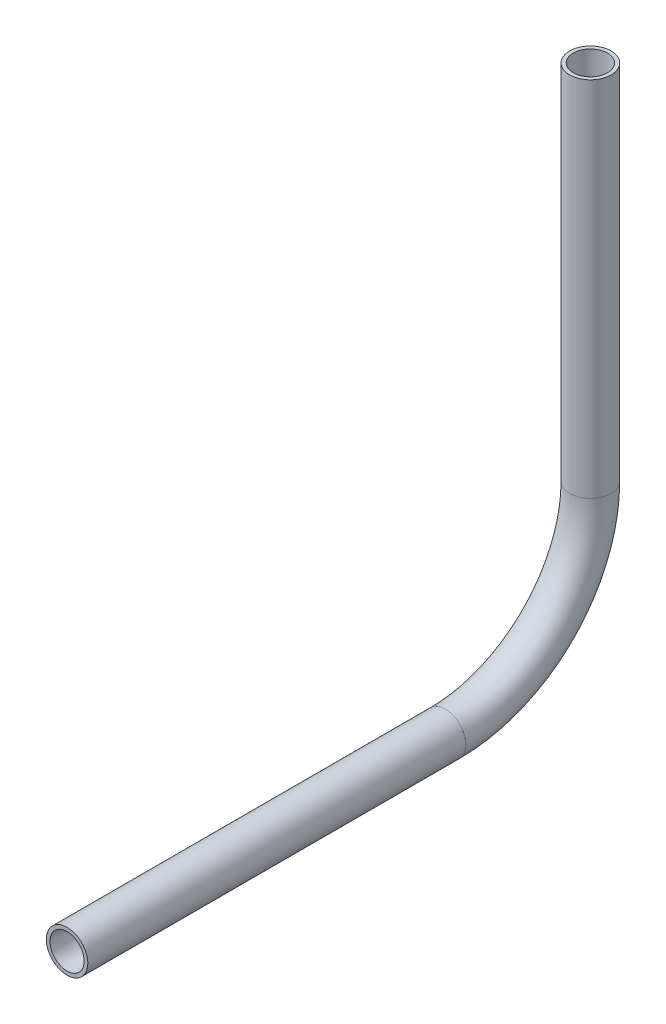
ISO-10303-21;
HEADER;
FILE_DESCRIPTION(('STEP AP214'),'2;1');
FILE_NAME('part.step','',(''),(''),'','','');
FILE_SCHEMA(('AUTOMOTIVE_DESIGN { 1 0 10303 214 1 1 1 1 }'));
ENDSEC;
DATA;
#1=APPLICATION_CONTEXT('core data for automotive mechanical design processes');
#2=APPLICATION_PROTOCOL_DEFINITION('international standard','automotive_design',2000,#1);
#3=PRODUCT_CONTEXT('',#1,'mechanical');
#4=PRODUCT('Part','Part','',(#3));
#5=PRODUCT_RELATED_PRODUCT_CATEGORY('part','',(#4));
#6=PRODUCT_DEFINITION_FORMATION('','',#4);
#7=PRODUCT_DEFINITION_CONTEXT('part definition',#1,'design');
#8=PRODUCT_DEFINITION('design','',#6,#7);
#9=PRODUCT_DEFINITION_SHAPE('','',#8);
#10=(LENGTH_UNIT() NAMED_UNIT(*) SI_UNIT(.MILLI.,.METRE.));
#11=(NAMED_UNIT(*) PLANE_ANGLE_UNIT() SI_UNIT($,.RADIAN.));
#12=(NAMED_UNIT(*) SI_UNIT($,.STERADIAN.) SOLID_ANGLE_UNIT());
#13=UNCERTAINTY_MEASURE_WITH_UNIT(LENGTH_MEASURE(1.E-05),#10,'distance_accuracy_value','');
#14=(GEOMETRIC_REPRESENTATION_CONTEXT(3) GLOBAL_UNCERTAINTY_ASSIGNED_CONTEXT((#13)) GLOBAL_UNIT_ASSIGNED_CONTEXT((#10,
#11,#12)) REPRESENTATION_CONTEXT('',''));
#15=CARTESIAN_POINT('',(0.,0.,0.));
#16=DIRECTION('',(0.,0.,1.));
#17=DIRECTION('',(1.,0.,0.));
#18=AXIS2_PLACEMENT_3D('',#15,#16,#17);
#19=CARTESIAN_POINT('',(0.,251.505538406434,74.7674547745198));
#20=DIRECTION('',(0.,0.,1.));
#21=DIRECTION('',(1.,0.,0.));
#22=AXIS2_PLACEMENT_3D('',#19,#20,#21);
#23=CYLINDRICAL_SURFACE('',#22,2.61620000000002);
#24=CARTESIAN_POINT('',(0.,251.505538406434,132.634510623571));
#25=DIRECTION('',(0.,0.,-1.));
#26=DIRECTION('',(-1.,0.,0.));
#27=AXIS2_PLACEMENT_3D('',#24,#25,#26);
#28=CIRCLE('',#27,2.61620000000002);
#29=CARTESIAN_POINT('',(-2.61620000000002,251.505538406434,132.634510623571));
#30=VERTEX_POINT('',#29);
#31=EDGE_CURVE('E55',#30,#30,#28,.T.);
#32=ORIENTED_EDGE('',*,*,#31,.F.);
#33=EDGE_LOOP('',(#32));
#34=FACE_BOUND('',#33,.T.);
#35=CARTESIAN_POINT('',(0.,251.505538406434,74.7674547745198));
#36=DIRECTION('',(0.,0.,-1.));
#37=DIRECTION('',(-1.,0.,0.));
#38=AXIS2_PLACEMENT_3D('',#35,#36,#37);
#39=CIRCLE('',#38,2.61620000000002);
#40=CARTESIAN_POINT('',(-2.61620000000002,251.505538406434,74.7674547745198));
#41=VERTEX_POINT('',#40);
#42=EDGE_CURVE('E51',#41,#41,#39,.T.);
#43=ORIENTED_EDGE('',*,*,#42,.T.);
#44=EDGE_LOOP('',(#43));
#45=FACE_BOUND('',#44,.T.);
#46=ADVANCED_FACE('F47',(#34,#45),#23,.F.);
#47=CARTESIAN_POINT('',(0.,251.505538406434,74.7674547745198));
#48=DIRECTION('',(0.,0.,1.));
#49=DIRECTION('',(1.,0.,0.));
#50=AXIS2_PLACEMENT_3D('',#47,#48,#49);
#51=CYLINDRICAL_SURFACE('',#50,3.17500000000002);
#52=CARTESIAN_POINT('',(0.,251.505538406434,132.634510623571));
#53=DIRECTION('',(0.,0.,-1.));
#54=DIRECTION('',(-1.,0.,0.));
#55=AXIS2_PLACEMENT_3D('',#52,#53,#54);
#56=CIRCLE('',#55,3.17500000000002);
#57=CARTESIAN_POINT('',(-3.17500000000002,251.505538406434,132.634510623571));
#58=VERTEX_POINT('',#57);
#59=EDGE_CURVE('E59',#58,#58,#56,.T.);
#60=ORIENTED_EDGE('',*,*,#59,.T.);
#61=EDGE_LOOP('',(#60));
#62=FACE_BOUND('',#61,.T.);
#63=CARTESIAN_POINT('',(0.,251.505538406434,74.7674547745198));
#64=DIRECTION('',(0.,0.,-1.));
#65=DIRECTION('',(-1.,0.,0.));
#66=AXIS2_PLACEMENT_3D('',#63,#64,#65);
#67=CIRCLE('',#66,3.17500000000002);
#68=CARTESIAN_POINT('',(-3.17500000000002,251.505538406434,74.7674547745198));
#69=VERTEX_POINT('',#68);
#70=EDGE_CURVE('E12',#69,#69,#67,.T.);
#71=ORIENTED_EDGE('',*,*,#70,.F.);
#72=EDGE_LOOP('',(#71));
#73=FACE_BOUND('',#72,.T.);
#74=ADVANCED_FACE('F74',(#62,#73),#51,.T.);
#75=CARTESIAN_POINT('',(0.,251.505538406434,132.634510623571));
#76=DIRECTION('',(0.,0.,-1.));
#77=DIRECTION('',(-1.,0.,0.));
#78=AXIS2_PLACEMENT_3D('',#75,#76,#77);
#79=PLANE('',#78);
#80=ORIENTED_EDGE('',*,*,#31,.T.);
#81=EDGE_LOOP('',(#80));
#82=FACE_BOUND('',#81,.T.);
#83=ORIENTED_EDGE('',*,*,#59,.F.);
#84=EDGE_LOOP('',(#83));
#85=FACE_BOUND('',#84,.T.);
#86=ADVANCED_FACE('F70',(#82,#85),#79,.F.);
#87=CARTESIAN_POINT('',(0.,251.505538406434,74.7674547745198));
#88=DIRECTION('',(0.,0.,-1.));
#89=DIRECTION('',(-1.,0.,0.));
#90=AXIS2_PLACEMENT_3D('',#87,#88,#89);
#91=PLANE('',#90);
#92=ORIENTED_EDGE('',*,*,#42,.F.);
#93=EDGE_LOOP('',(#92));
#94=FACE_BOUND('',#93,.T.);
#95=ORIENTED_EDGE('',*,*,#70,.T.);
#96=EDGE_LOOP('',(#95));
#97=FACE_BOUND('',#96,.T.);
#98=ADVANCED_FACE('F49',(#94,#97),#91,.T.);
#99=CLOSED_SHELL('',(#46,#74,#86,#98));
#100=MANIFOLD_SOLID_BREP('B2',#99);
#101=CARTESIAN_POINT('',(0.,273.730538406434,74.7674547745198));
#102=DIRECTION('',(-1.,0.,0.));
#103=DIRECTION('',(0.,0.,1.));
#104=AXIS2_PLACEMENT_3D('',#101,#102,#103);
#105=TOROIDAL_SURFACE('',#104,22.225,2.61620000000002);
#106=CARTESIAN_POINT('',(0.,273.730538406434,52.5424547745199));
#107=DIRECTION('',(0.,1.,0.));
#108=DIRECTION('',(0.,0.,1.));
#109=AXIS2_PLACEMENT_3D('',#106,#107,#108);
#110=CIRCLE('',#109,2.61620000000002);
#111=CARTESIAN_POINT('',(0.,273.730538406434,49.9262547745198));
#112=VERTEX_POINT('',#111);
#113=EDGE_CURVE('E150',#112,#112,#110,.T.);
#114=CARTESIAN_POINT('',(0.,251.505538406434,74.7674547745198));
#115=DIRECTION('',(0.,0.,1.));
#116=DIRECTION('',(1.,0.,0.));
#117=AXIS2_PLACEMENT_3D('',#114,#115,#116);
#118=CIRCLE('',#117,2.61620000000002);
#119=CARTESIAN_POINT('',(0.,248.889338406434,74.7674547745198));
#120=VERTEX_POINT('',#119);
#121=EDGE_CURVE('E140',#120,#120,#118,.T.);
#122=CARTESIAN_POINT('',(0.,273.730538406434,74.7674547745198));
#123=DIRECTION('',(-1.,0.,0.));
#124=DIRECTION('',(0.,0.,1.));
#125=AXIS2_PLACEMENT_3D('',#122,#123,#124);
#126=CIRCLE('',#125,24.8412);
#127=EDGE_CURVE('',#112,#120,#126,.T.);
#128=ORIENTED_EDGE('',*,*,#113,.T.);
#129=ORIENTED_EDGE('',*,*,#121,.T.);
#130=ORIENTED_EDGE('',*,*,#127,.T.);
#131=ORIENTED_EDGE('',*,*,#127,.F.);
#132=EDGE_LOOP('',(#128,#130,#129,#131));
#133=FACE_BOUND('',#132,.T.);
#134=ADVANCED_FACE('F136',(#133),#105,.F.);
#135=CARTESIAN_POINT('',(0.,273.730538406434,74.7674547745198));
#136=DIRECTION('',(-1.,0.,0.));
#137=DIRECTION('',(0.,0.,1.));
#138=AXIS2_PLACEMENT_3D('',#135,#136,#137);
#139=TOROIDAL_SURFACE('',#138,22.225,3.17500000000002);
#140=CARTESIAN_POINT('',(0.,273.730538406434,52.5424547745199));
#141=DIRECTION('',(0.,1.,0.));
#142=DIRECTION('',(0.,0.,1.));
#143=AXIS2_PLACEMENT_3D('',#140,#141,#142);
#144=CIRCLE('',#143,3.17500000000002);
#145=CARTESIAN_POINT('',(0.,273.730538406434,49.3674547745198));
#146=VERTEX_POINT('',#145);
#147=EDGE_CURVE('E144',#146,#146,#144,.T.);
#148=CARTESIAN_POINT('',(0.,251.505538406434,74.7674547745198));
#149=DIRECTION('',(0.,0.,1.));
#150=DIRECTION('',(1.,0.,0.));
#151=AXIS2_PLACEMENT_3D('',#148,#149,#150);
#152=CIRCLE('',#151,3.17500000000002);
#153=CARTESIAN_POINT('',(0.,248.330538406434,74.7674547745198));
#154=VERTEX_POINT('',#153);
#155=EDGE_CURVE('E46',#154,#154,#152,.T.);
#156=CARTESIAN_POINT('',(0.,273.730538406434,74.7674547745198));
#157=DIRECTION('',(-1.,0.,0.));
#158=DIRECTION('',(0.,0.,1.));
#159=AXIS2_PLACEMENT_3D('',#156,#157,#158);
#160=CIRCLE('',#159,25.4);
#161=EDGE_CURVE('',#146,#154,#160,.T.);
#162=ORIENTED_EDGE('',*,*,#147,.F.);
#163=ORIENTED_EDGE('',*,*,#155,.F.);
#164=ORIENTED_EDGE('',*,*,#161,.T.);
#165=ORIENTED_EDGE('',*,*,#161,.F.);
#166=EDGE_LOOP('',(#162,#164,#163,#165));
#167=FACE_BOUND('',#166,.T.);
#168=ADVANCED_FACE('F163',(#167),#139,.T.);
#169=CARTESIAN_POINT('',(0.,273.730538406434,52.5424547745199));
#170=DIRECTION('',(0.,1.,0.));
#171=DIRECTION('',(0.,0.,1.));
#172=AXIS2_PLACEMENT_3D('',#169,#170,#171);
#173=PLANE('',#172);
#174=ORIENTED_EDGE('',*,*,#113,.F.);
#175=EDGE_LOOP('',(#174));
#176=FACE_BOUND('',#175,.T.);
#177=ORIENTED_EDGE('',*,*,#147,.T.);
#178=EDGE_LOOP('',(#177));
#179=FACE_BOUND('',#178,.T.);
#180=ADVANCED_FACE('F159',(#176,#179),#173,.T.);
#181=CARTESIAN_POINT('',(0.,251.505538406434,74.7674547745198));
#182=DIRECTION('',(0.,0.,1.));
#183=DIRECTION('',(1.,0.,0.));
#184=AXIS2_PLACEMENT_3D('',#181,#182,#183);
#185=PLANE('',#184);
#186=ORIENTED_EDGE('',*,*,#121,.F.);
#187=EDGE_LOOP('',(#186));
#188=FACE_BOUND('',#187,.T.);
#189=ORIENTED_EDGE('',*,*,#155,.T.);
#190=EDGE_LOOP('',(#189));
#191=FACE_BOUND('',#190,.T.);
#192=ADVANCED_FACE('F138',(#188,#191),#185,.T.);
#193=CLOSED_SHELL('',(#134,#168,#180,#192));
#194=MANIFOLD_SOLID_BREP('B7',#193);
#195=CARTESIAN_POINT('',(0.,329.200645489302,52.5424547745199));
#196=DIRECTION('',(0.,-1.,0.));
#197=DIRECTION('',(0.,0.,-1.));
#198=AXIS2_PLACEMENT_3D('',#195,#196,#197);
#199=CYLINDRICAL_SURFACE('',#198,2.61620000000002);
#200=CARTESIAN_POINT('',(0.,329.200645489302,52.5424547745199));
#201=DIRECTION('',(0.,1.,0.));
#202=DIRECTION('',(-1.,0.,0.));
#203=AXIS2_PLACEMENT_3D('',#200,#201,#202);
#204=CIRCLE('',#203,2.61620000000002);
#205=CARTESIAN_POINT('',(-2.61620000000002,329.200645489302,52.5424547745199));
#206=VERTEX_POINT('',#205);
#207=EDGE_CURVE('E234',#206,#206,#204,.T.);
#208=ORIENTED_EDGE('',*,*,#207,.T.);
#209=EDGE_LOOP('',(#208));
#210=FACE_BOUND('',#209,.T.);
#211=CARTESIAN_POINT('',(0.,273.730538406434,52.5424547745199));
#212=DIRECTION('',(0.,-1.,0.));
#213=DIRECTION('',(0.,0.,-1.));
#214=AXIS2_PLACEMENT_3D('',#211,#212,#213);
#215=CIRCLE('',#214,2.61620000000002);
#216=CARTESIAN_POINT('',(0.,273.730538406434,49.9262547745198));
#217=VERTEX_POINT('',#216);
#218=EDGE_CURVE('E224',#217,#217,#215,.T.);
#219=ORIENTED_EDGE('',*,*,#218,.T.);
#220=EDGE_LOOP('',(#219));
#221=FACE_BOUND('',#220,.T.);
#222=ADVANCED_FACE('F220',(#210,#221),#199,.F.);
#223=CARTESIAN_POINT('',(0.,329.200645489302,52.5424547745199));
#224=DIRECTION('',(0.,-1.,0.));
#225=DIRECTION('',(0.,0.,-1.));
#226=AXIS2_PLACEMENT_3D('',#223,#224,#225);
#227=CYLINDRICAL_SURFACE('',#226,3.17500000000002);
#228=CARTESIAN_POINT('',(0.,329.200645489302,52.5424547745199));
#229=DIRECTION('',(0.,1.,0.));
#230=DIRECTION('',(-1.,0.,0.));
#231=AXIS2_PLACEMENT_3D('',#228,#229,#230);
#232=CIRCLE('',#231,3.17500000000002);
#233=CARTESIAN_POINT('',(-3.17500000000002,329.200645489302,52.5424547745199));
#234=VERTEX_POINT('',#233);
#235=EDGE_CURVE('E228',#234,#234,#232,.T.);
#236=ORIENTED_EDGE('',*,*,#235,.F.);
#237=EDGE_LOOP('',(#236));
#238=FACE_BOUND('',#237,.T.);
#239=CARTESIAN_POINT('',(0.,273.730538406434,52.5424547745199));
#240=DIRECTION('',(0.,-1.,0.));
#241=DIRECTION('',(0.,0.,-1.));
#242=AXIS2_PLACEMENT_3D('',#239,#240,#241);
#243=CIRCLE('',#242,3.17500000000002);
#244=CARTESIAN_POINT('',(0.,273.730538406434,49.3674547745198));
#245=VERTEX_POINT('',#244);
#246=EDGE_CURVE('E135',#245,#245,#243,.T.);
#247=ORIENTED_EDGE('',*,*,#246,.F.);
#248=EDGE_LOOP('',(#247));
#249=FACE_BOUND('',#248,.T.);
#250=ADVANCED_FACE('F247',(#238,#249),#227,.T.);
#251=CARTESIAN_POINT('',(0.,329.200645489302,52.5424547745199));
#252=DIRECTION('',(0.,1.,0.));
#253=DIRECTION('',(-1.,0.,0.));
#254=AXIS2_PLACEMENT_3D('',#251,#252,#253);
#255=PLANE('',#254);
#256=ORIENTED_EDGE('',*,*,#207,.F.);
#257=EDGE_LOOP('',(#256));
#258=FACE_BOUND('',#257,.T.);
#259=ORIENTED_EDGE('',*,*,#235,.T.);
#260=EDGE_LOOP('',(#259));
#261=FACE_BOUND('',#260,.T.);
#262=ADVANCED_FACE('F243',(#258,#261),#255,.T.);
#263=CARTESIAN_POINT('',(0.,273.730538406434,52.5424547745199));
#264=DIRECTION('',(0.,-1.,0.));
#265=DIRECTION('',(0.,0.,-1.));
#266=AXIS2_PLACEMENT_3D('',#263,#264,#265);
#267=PLANE('',#266);
#268=ORIENTED_EDGE('',*,*,#218,.F.);
#269=EDGE_LOOP('',(#268));
#270=FACE_BOUND('',#269,.T.);
#271=ORIENTED_EDGE('',*,*,#246,.T.);
#272=EDGE_LOOP('',(#271));
#273=FACE_BOUND('',#272,.T.);
#274=ADVANCED_FACE('F222',(#270,#273),#267,.T.);
#275=CLOSED_SHELL('',(#222,#250,#262,#274));
#276=MANIFOLD_SOLID_BREP('B41',#275);
#277=ADVANCED_BREP_SHAPE_REPRESENTATION('',(#18,#100,#194,#276),#14);
#278=SHAPE_DEFINITION_REPRESENTATION(#9,#277);
ENDSEC;
END-ISO-10303-21;
